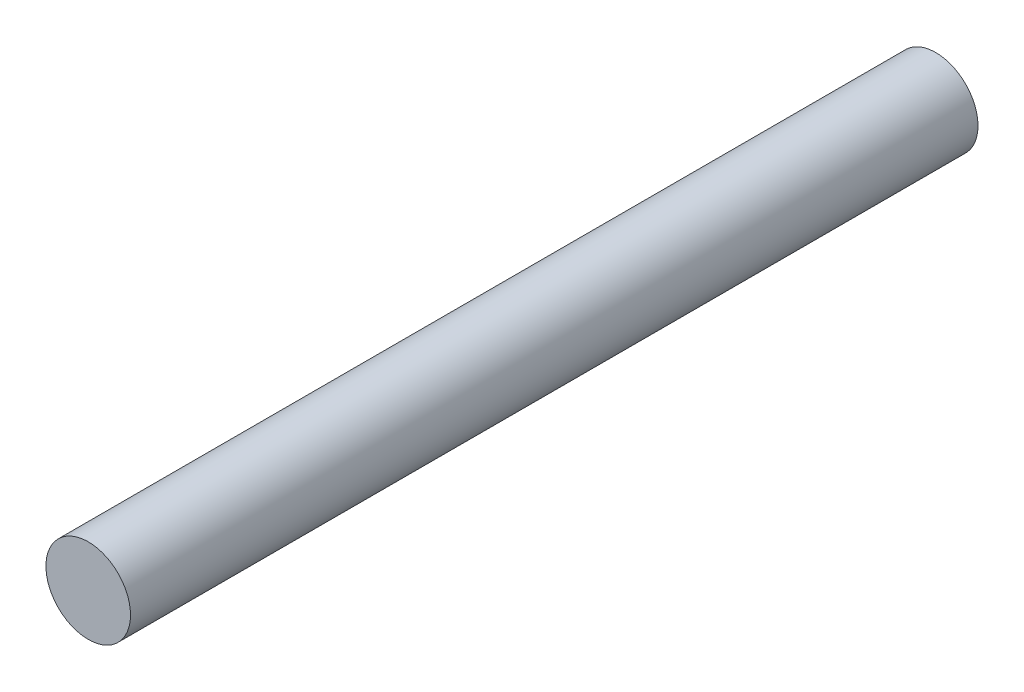
ISO-10303-21;
HEADER;
FILE_DESCRIPTION(('STEP AP214'),'2;1');
FILE_NAME('part.step','',(''),(''),'','','');
FILE_SCHEMA(('AUTOMOTIVE_DESIGN { 1 0 10303 214 1 1 1 1 }'));
ENDSEC;
DATA;
#1=APPLICATION_CONTEXT('core data for automotive mechanical design processes');
#2=APPLICATION_PROTOCOL_DEFINITION('international standard','automotive_design',2000,#1);
#3=PRODUCT_CONTEXT('',#1,'mechanical');
#4=PRODUCT('Part','Part','',(#3));
#5=PRODUCT_RELATED_PRODUCT_CATEGORY('part','',(#4));
#6=PRODUCT_DEFINITION_FORMATION('','',#4);
#7=PRODUCT_DEFINITION_CONTEXT('part definition',#1,'design');
#8=PRODUCT_DEFINITION('design','',#6,#7);
#9=PRODUCT_DEFINITION_SHAPE('','',#8);
#10=(LENGTH_UNIT() NAMED_UNIT(*) SI_UNIT(.MILLI.,.METRE.));
#11=(NAMED_UNIT(*) PLANE_ANGLE_UNIT() SI_UNIT($,.RADIAN.));
#12=(NAMED_UNIT(*) SI_UNIT($,.STERADIAN.) SOLID_ANGLE_UNIT());
#13=UNCERTAINTY_MEASURE_WITH_UNIT(LENGTH_MEASURE(1.E-05),#10,'distance_accuracy_value','');
#14=(GEOMETRIC_REPRESENTATION_CONTEXT(3) GLOBAL_UNCERTAINTY_ASSIGNED_CONTEXT((#13)) GLOBAL_UNIT_ASSIGNED_CONTEXT((#10,
#11,#12)) REPRESENTATION_CONTEXT('',''));
#15=CARTESIAN_POINT('',(0.,0.,0.));
#16=DIRECTION('',(0.,0.,1.));
#17=DIRECTION('',(1.,0.,0.));
#18=AXIS2_PLACEMENT_3D('',#15,#16,#17);
#19=CARTESIAN_POINT('',(0.,0.,25.44572));
#20=DIRECTION('',(0.,0.,-1.));
#21=DIRECTION('',(-1.,0.,0.));
#22=AXIS2_PLACEMENT_3D('',#19,#20,#21);
#23=CYLINDRICAL_SURFACE('',#22,1.27);
#24=CARTESIAN_POINT('',(0.,0.,25.44572));
#25=DIRECTION('',(0.,0.,1.));
#26=DIRECTION('',(1.,0.,0.));
#27=AXIS2_PLACEMENT_3D('',#24,#25,#26);
#28=CIRCLE('',#27,1.27);
#29=CARTESIAN_POINT('',(1.27,0.,25.44572));
#30=VERTEX_POINT('',#29);
#31=EDGE_CURVE('E10',#30,#30,#28,.T.);
#32=ORIENTED_EDGE('',*,*,#31,.F.);
#33=EDGE_LOOP('',(#32));
#34=FACE_BOUND('',#33,.T.);
#35=CARTESIAN_POINT('',(0.,0.,0.));
#36=DIRECTION('',(0.,0.,1.));
#37=DIRECTION('',(1.,0.,0.));
#38=AXIS2_PLACEMENT_3D('',#35,#36,#37);
#39=CIRCLE('',#38,1.27);
#40=CARTESIAN_POINT('',(1.27,0.,0.));
#41=VERTEX_POINT('',#40);
#42=EDGE_CURVE('E31',#41,#41,#39,.T.);
#43=ORIENTED_EDGE('',*,*,#42,.T.);
#44=EDGE_LOOP('',(#43));
#45=FACE_BOUND('',#44,.T.);
#46=ADVANCED_FACE('F28',(#34,#45),#23,.T.);
#47=CARTESIAN_POINT('',(0.,0.,25.44572));
#48=DIRECTION('',(0.,0.,1.));
#49=DIRECTION('',(1.,0.,0.));
#50=AXIS2_PLACEMENT_3D('',#47,#48,#49);
#51=PLANE('',#50);
#52=ORIENTED_EDGE('',*,*,#31,.T.);
#53=EDGE_LOOP('',(#52));
#54=FACE_BOUND('',#53,.T.);
#55=ADVANCED_FACE('F43',(#54),#51,.T.);
#56=CARTESIAN_POINT('',(0.,0.,0.));
#57=DIRECTION('',(0.,0.,1.));
#58=DIRECTION('',(1.,0.,0.));
#59=AXIS2_PLACEMENT_3D('',#56,#57,#58);
#60=PLANE('',#59);
#61=ORIENTED_EDGE('',*,*,#42,.F.);
#62=EDGE_LOOP('',(#61));
#63=FACE_BOUND('',#62,.T.);
#64=ADVANCED_FACE('F41',(#63),#60,.F.);
#65=CLOSED_SHELL('',(#46,#55,#64));
#66=MANIFOLD_SOLID_BREP('B2',#65);
#67=ADVANCED_BREP_SHAPE_REPRESENTATION('',(#18,#66),#14);
#68=SHAPE_DEFINITION_REPRESENTATION(#9,#67);
ENDSEC;
END-ISO-10303-21;
